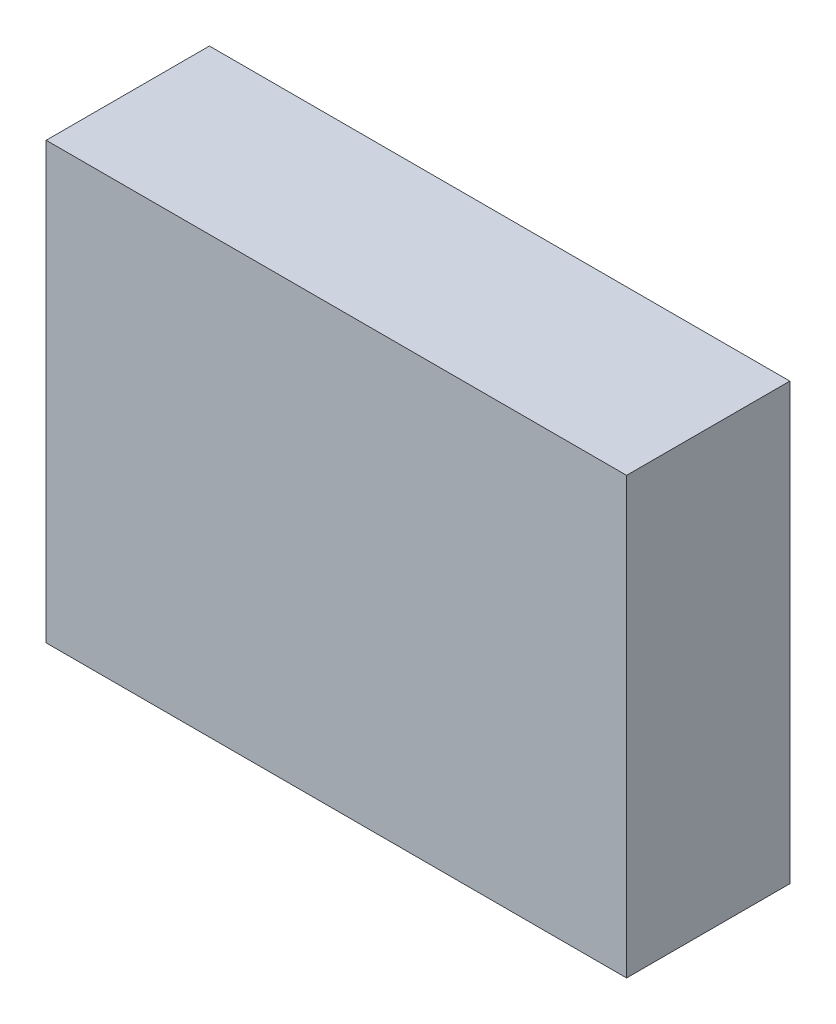
ISO-10303-21;
HEADER;
FILE_DESCRIPTION(('STEP AP214'),'2;1');
FILE_NAME('part.step','',(''),(''),'','','');
FILE_SCHEMA(('AUTOMOTIVE_DESIGN { 1 0 10303 214 1 1 1 1 }'));
ENDSEC;
DATA;
#1=APPLICATION_CONTEXT('core data for automotive mechanical design processes');
#2=APPLICATION_PROTOCOL_DEFINITION('international standard','automotive_design',2000,#1);
#3=PRODUCT_CONTEXT('',#1,'mechanical');
#4=PRODUCT('Part','Part','',(#3));
#5=PRODUCT_RELATED_PRODUCT_CATEGORY('part','',(#4));
#6=PRODUCT_DEFINITION_FORMATION('','',#4);
#7=PRODUCT_DEFINITION_CONTEXT('part definition',#1,'design');
#8=PRODUCT_DEFINITION('design','',#6,#7);
#9=PRODUCT_DEFINITION_SHAPE('','',#8);
#10=(LENGTH_UNIT() NAMED_UNIT(*) SI_UNIT(.MILLI.,.METRE.));
#11=(NAMED_UNIT(*) PLANE_ANGLE_UNIT() SI_UNIT($,.RADIAN.));
#12=(NAMED_UNIT(*) SI_UNIT($,.STERADIAN.) SOLID_ANGLE_UNIT());
#13=UNCERTAINTY_MEASURE_WITH_UNIT(LENGTH_MEASURE(1.E-05),#10,'distance_accuracy_value','');
#14=(GEOMETRIC_REPRESENTATION_CONTEXT(3) GLOBAL_UNCERTAINTY_ASSIGNED_CONTEXT((#13)) GLOBAL_UNIT_ASSIGNED_CONTEXT((#10,
#11,#12)) REPRESENTATION_CONTEXT('',''));
#15=CARTESIAN_POINT('',(0.,0.,0.));
#16=DIRECTION('',(0.,0.,1.));
#17=DIRECTION('',(1.,0.,0.));
#18=AXIS2_PLACEMENT_3D('',#15,#16,#17);
#19=CARTESIAN_POINT('',(6.800006232969,10.149998686074,0.4499991));
#20=DIRECTION('',(0.,0.,-1.));
#21=DIRECTION('',(0.,-1.,0.));
#22=AXIS2_PLACEMENT_3D('',#19,#20,#21);
#23=PLANE('',#22);
#24=DIRECTION('',(0.,-1.,0.));
#25=VECTOR('',#24,1.);
#26=CARTESIAN_POINT('',(6.800006232969,10.149998686074,0.4499991));
#27=LINE('',#26,#25);
#28=CARTESIAN_POINT('',(6.800006232969,10.149998686074,0.4499991));
#29=VERTEX_POINT('',#28);
#30=CARTESIAN_POINT('',(6.800006232969,8.950001086074,0.4499991));
#31=VERTEX_POINT('',#30);
#32=EDGE_CURVE('E82',#29,#31,#27,.T.);
#33=ORIENTED_EDGE('',*,*,#32,.T.);
#34=DIRECTION('',(1.,0.,0.));
#35=VECTOR('',#34,1.);
#36=CARTESIAN_POINT('',(6.800006232969,8.950001086074,0.4499991));
#37=LINE('',#36,#35);
#38=CARTESIAN_POINT('',(8.400008112969,8.950001086074,0.4499991));
#39=VERTEX_POINT('',#38);
#40=EDGE_CURVE('E104',#31,#39,#37,.T.);
#41=ORIENTED_EDGE('',*,*,#40,.T.);
#42=DIRECTION('',(0.,1.,0.));
#43=VECTOR('',#42,1.);
#44=CARTESIAN_POINT('',(8.400008112969,8.950001086074,0.4499991));
#45=LINE('',#44,#43);
#46=CARTESIAN_POINT('',(8.400008112969,10.149998686074,0.4499991));
#47=VERTEX_POINT('',#46);
#48=EDGE_CURVE('E74',#39,#47,#45,.T.);
#49=ORIENTED_EDGE('',*,*,#48,.T.);
#50=DIRECTION('',(-1.,0.,0.));
#51=VECTOR('',#50,1.);
#52=CARTESIAN_POINT('',(8.400008112969,10.149998686074,0.4499991));
#53=LINE('',#52,#51);
#54=EDGE_CURVE('E11',#47,#29,#53,.T.);
#55=ORIENTED_EDGE('',*,*,#54,.T.);
#56=EDGE_LOOP('',(#33,#41,#49,#55));
#57=FACE_BOUND('',#56,.T.);
#58=ADVANCED_FACE('F17',(#57),#23,.F.);
#59=CARTESIAN_POINT('',(6.800006232969,10.149998686074,0.));
#60=DIRECTION('',(0.,0.,-1.));
#61=DIRECTION('',(0.,-1.,0.));
#62=AXIS2_PLACEMENT_3D('',#59,#60,#61);
#63=PLANE('',#62);
#64=DIRECTION('',(-1.,0.,0.));
#65=VECTOR('',#64,1.);
#66=CARTESIAN_POINT('',(8.400008112969,10.149998686074,0.));
#67=LINE('',#66,#65);
#68=CARTESIAN_POINT('',(8.400008112969,10.149998686074,0.));
#69=VERTEX_POINT('',#68);
#70=CARTESIAN_POINT('',(6.800006232969,10.149998686074,0.));
#71=VERTEX_POINT('',#70);
#72=EDGE_CURVE('E25',#69,#71,#67,.T.);
#73=ORIENTED_EDGE('',*,*,#72,.F.);
#74=DIRECTION('',(0.,1.,0.));
#75=VECTOR('',#74,1.);
#76=CARTESIAN_POINT('',(8.400008112969,8.950001086074,0.));
#77=LINE('',#76,#75);
#78=CARTESIAN_POINT('',(8.400008112969,8.950001086074,0.));
#79=VERTEX_POINT('',#78);
#80=EDGE_CURVE('E97',#79,#69,#77,.T.);
#81=ORIENTED_EDGE('',*,*,#80,.F.);
#82=DIRECTION('',(1.,0.,0.));
#83=VECTOR('',#82,1.);
#84=CARTESIAN_POINT('',(6.800006232969,8.950001086074,0.));
#85=LINE('',#84,#83);
#86=CARTESIAN_POINT('',(6.800006232969,8.950001086074,0.));
#87=VERTEX_POINT('',#86);
#88=EDGE_CURVE('E84',#87,#79,#85,.T.);
#89=ORIENTED_EDGE('',*,*,#88,.F.);
#90=DIRECTION('',(0.,-1.,0.));
#91=VECTOR('',#90,1.);
#92=CARTESIAN_POINT('',(6.800006232969,10.149998686074,0.));
#93=LINE('',#92,#91);
#94=EDGE_CURVE('E80',#71,#87,#93,.T.);
#95=ORIENTED_EDGE('',*,*,#94,.F.);
#96=EDGE_LOOP('',(#73,#81,#89,#95));
#97=FACE_BOUND('',#96,.T.);
#98=ADVANCED_FACE('F86',(#97),#63,.T.);
#99=CARTESIAN_POINT('',(8.400008112969,10.149998686074,0.));
#100=DIRECTION('',(0.,-1.,0.));
#101=DIRECTION('',(0.,0.,-1.));
#102=AXIS2_PLACEMENT_3D('',#99,#100,#101);
#103=PLANE('',#102);
#104=ORIENTED_EDGE('',*,*,#72,.T.);
#105=DIRECTION('',(0.,0.,1.));
#106=VECTOR('',#105,1.);
#107=CARTESIAN_POINT('',(6.800006232969,10.149998686074,0.));
#108=LINE('',#107,#106);
#109=EDGE_CURVE('E68',#71,#29,#108,.T.);
#110=ORIENTED_EDGE('',*,*,#109,.T.);
#111=ORIENTED_EDGE('',*,*,#54,.F.);
#112=DIRECTION('',(0.,0.,1.));
#113=VECTOR('',#112,1.);
#114=CARTESIAN_POINT('',(8.400008112969,10.149998686074,0.));
#115=LINE('',#114,#113);
#116=EDGE_CURVE('E71',#69,#47,#115,.T.);
#117=ORIENTED_EDGE('',*,*,#116,.F.);
#118=EDGE_LOOP('',(#104,#110,#111,#117));
#119=FACE_BOUND('',#118,.T.);
#120=ADVANCED_FACE('F67',(#119),#103,.F.);
#121=CARTESIAN_POINT('',(8.400008112969,8.950001086074,0.));
#122=DIRECTION('',(-1.,0.,0.));
#123=DIRECTION('',(0.,0.,1.));
#124=AXIS2_PLACEMENT_3D('',#121,#122,#123);
#125=PLANE('',#124);
#126=ORIENTED_EDGE('',*,*,#80,.T.);
#127=ORIENTED_EDGE('',*,*,#116,.T.);
#128=ORIENTED_EDGE('',*,*,#48,.F.);
#129=DIRECTION('',(0.,0.,1.));
#130=VECTOR('',#129,1.);
#131=CARTESIAN_POINT('',(8.400008112969,8.950001086074,0.));
#132=LINE('',#131,#130);
#133=EDGE_CURVE('E103',#79,#39,#132,.T.);
#134=ORIENTED_EDGE('',*,*,#133,.F.);
#135=EDGE_LOOP('',(#126,#127,#128,#134));
#136=FACE_BOUND('',#135,.T.);
#137=ADVANCED_FACE('F117',(#136),#125,.F.);
#138=CARTESIAN_POINT('',(6.800006232969,8.950001086074,0.));
#139=DIRECTION('',(0.,1.,0.));
#140=DIRECTION('',(1.,0.,0.));
#141=AXIS2_PLACEMENT_3D('',#138,#139,#140);
#142=PLANE('',#141);
#143=ORIENTED_EDGE('',*,*,#88,.T.);
#144=ORIENTED_EDGE('',*,*,#133,.T.);
#145=ORIENTED_EDGE('',*,*,#40,.F.);
#146=DIRECTION('',(0.,0.,1.));
#147=VECTOR('',#146,1.);
#148=CARTESIAN_POINT('',(6.800006232969,8.950001086074,0.));
#149=LINE('',#148,#147);
#150=EDGE_CURVE('E90',#87,#31,#149,.T.);
#151=ORIENTED_EDGE('',*,*,#150,.F.);
#152=EDGE_LOOP('',(#143,#144,#145,#151));
#153=FACE_BOUND('',#152,.T.);
#154=ADVANCED_FACE('F119',(#153),#142,.F.);
#155=CARTESIAN_POINT('',(6.800006232969,10.149998686074,0.));
#156=DIRECTION('',(1.,0.,0.));
#157=DIRECTION('',(0.,1.,0.));
#158=AXIS2_PLACEMENT_3D('',#155,#156,#157);
#159=PLANE('',#158);
#160=ORIENTED_EDGE('',*,*,#94,.T.);
#161=ORIENTED_EDGE('',*,*,#150,.T.);
#162=ORIENTED_EDGE('',*,*,#32,.F.);
#163=ORIENTED_EDGE('',*,*,#109,.F.);
#164=EDGE_LOOP('',(#160,#161,#162,#163));
#165=FACE_BOUND('',#164,.T.);
#166=ADVANCED_FACE('F78',(#165),#159,.F.);
#167=CLOSED_SHELL('',(#58,#98,#120,#137,#154,#166));
#168=MANIFOLD_SOLID_BREP('B1',#167);
#169=ADVANCED_BREP_SHAPE_REPRESENTATION('',(#18,#168),#14);
#170=SHAPE_DEFINITION_REPRESENTATION(#9,#169);
ENDSEC;
END-ISO-10303-21;
